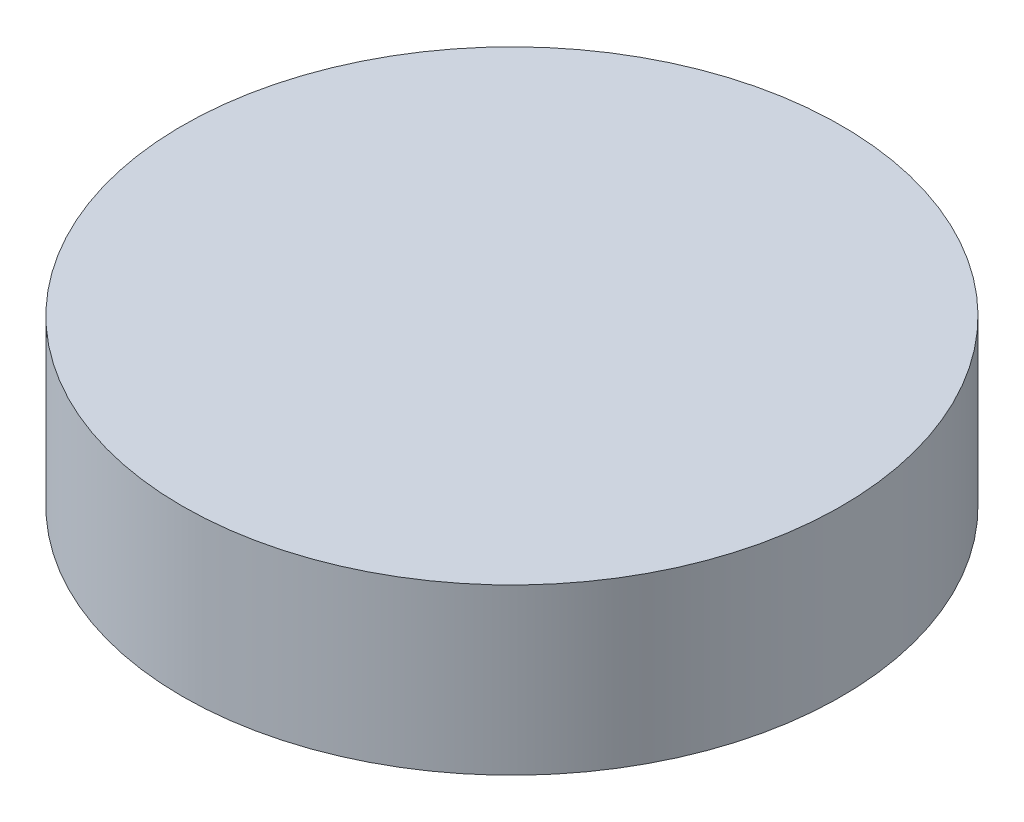
ISO-10303-21;
HEADER;
FILE_DESCRIPTION(('STEP AP214'),'2;1');
FILE_NAME('part.step','',(''),(''),'','','');
FILE_SCHEMA(('AUTOMOTIVE_DESIGN { 1 0 10303 214 1 1 1 1 }'));
ENDSEC;
DATA;
#1=APPLICATION_CONTEXT('core data for automotive mechanical design processes');
#2=APPLICATION_PROTOCOL_DEFINITION('international standard','automotive_design',2000,#1);
#3=PRODUCT_CONTEXT('',#1,'mechanical');
#4=PRODUCT('Part','Part','',(#3));
#5=PRODUCT_RELATED_PRODUCT_CATEGORY('part','',(#4));
#6=PRODUCT_DEFINITION_FORMATION('','',#4);
#7=PRODUCT_DEFINITION_CONTEXT('part definition',#1,'design');
#8=PRODUCT_DEFINITION('design','',#6,#7);
#9=PRODUCT_DEFINITION_SHAPE('','',#8);
#10=(LENGTH_UNIT() NAMED_UNIT(*) SI_UNIT(.MILLI.,.METRE.));
#11=(NAMED_UNIT(*) PLANE_ANGLE_UNIT() SI_UNIT($,.RADIAN.));
#12=(NAMED_UNIT(*) SI_UNIT($,.STERADIAN.) SOLID_ANGLE_UNIT());
#13=UNCERTAINTY_MEASURE_WITH_UNIT(LENGTH_MEASURE(1.E-05),#10,'distance_accuracy_value','');
#14=(GEOMETRIC_REPRESENTATION_CONTEXT(3) GLOBAL_UNCERTAINTY_ASSIGNED_CONTEXT((#13)) GLOBAL_UNIT_ASSIGNED_CONTEXT((#10,
#11,#12)) REPRESENTATION_CONTEXT('',''));
#15=CARTESIAN_POINT('',(0.,0.,0.));
#16=DIRECTION('',(0.,0.,1.));
#17=DIRECTION('',(1.,0.,0.));
#18=AXIS2_PLACEMENT_3D('',#15,#16,#17);
#19=CARTESIAN_POINT('',(0.,1.5,0.));
#20=DIRECTION('',(0.,-1.,0.));
#21=DIRECTION('',(0.,0.,-1.));
#22=AXIS2_PLACEMENT_3D('',#19,#20,#21);
#23=CYLINDRICAL_SURFACE('',#22,3.);
#24=CARTESIAN_POINT('',(0.,1.5,0.));
#25=DIRECTION('',(0.,1.,0.));
#26=DIRECTION('',(0.,0.,1.));
#27=AXIS2_PLACEMENT_3D('',#24,#25,#26);
#28=CIRCLE('',#27,3.);
#29=CARTESIAN_POINT('',(0.,1.5,3.));
#30=VERTEX_POINT('',#29);
#31=EDGE_CURVE('E10',#30,#30,#28,.T.);
#32=ORIENTED_EDGE('',*,*,#31,.F.);
#33=EDGE_LOOP('',(#32));
#34=FACE_BOUND('',#33,.T.);
#35=CARTESIAN_POINT('',(0.,0.,0.));
#36=DIRECTION('',(0.,1.,0.));
#37=DIRECTION('',(0.,0.,1.));
#38=AXIS2_PLACEMENT_3D('',#35,#36,#37);
#39=CIRCLE('',#38,3.);
#40=CARTESIAN_POINT('',(0.,0.,3.));
#41=VERTEX_POINT('',#40);
#42=EDGE_CURVE('E40',#41,#41,#39,.T.);
#43=ORIENTED_EDGE('',*,*,#42,.T.);
#44=EDGE_LOOP('',(#43));
#45=FACE_BOUND('',#44,.T.);
#46=ADVANCED_FACE('F37',(#34,#45),#23,.T.);
#47=CARTESIAN_POINT('',(0.,1.5,0.));
#48=DIRECTION('',(0.,1.,0.));
#49=DIRECTION('',(0.,0.,1.));
#50=AXIS2_PLACEMENT_3D('',#47,#48,#49);
#51=PLANE('',#50);
#52=ORIENTED_EDGE('',*,*,#31,.T.);
#53=EDGE_LOOP('',(#52));
#54=FACE_BOUND('',#53,.T.);
#55=ADVANCED_FACE('F52',(#54),#51,.T.);
#56=CARTESIAN_POINT('',(0.,0.,0.));
#57=DIRECTION('',(0.,1.,0.));
#58=DIRECTION('',(0.,0.,1.));
#59=AXIS2_PLACEMENT_3D('',#56,#57,#58);
#60=PLANE('',#59);
#61=ORIENTED_EDGE('',*,*,#42,.F.);
#62=EDGE_LOOP('',(#61));
#63=FACE_BOUND('',#62,.T.);
#64=ADVANCED_FACE('F50',(#63),#60,.F.);
#65=CLOSED_SHELL('',(#46,#55,#64));
#66=MANIFOLD_SOLID_BREP('B2',#65);
#67=ADVANCED_BREP_SHAPE_REPRESENTATION('',(#18,#66),#14);
#68=SHAPE_DEFINITION_REPRESENTATION(#9,#67);
ENDSEC;
END-ISO-10303-21;
